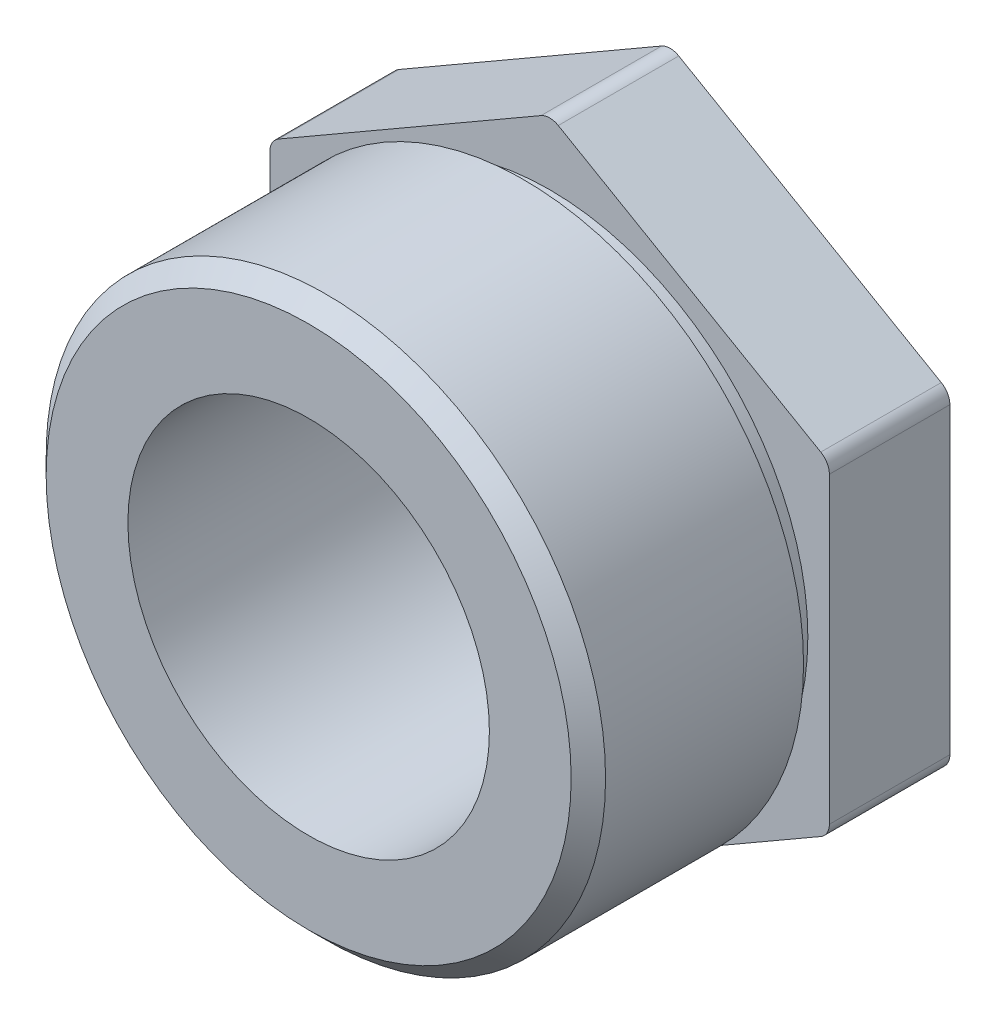
ISO-10303-21;
HEADER;
FILE_DESCRIPTION(('STEP AP214'),'2;1');
FILE_NAME('part.step','',(''),(''),'','','');
FILE_SCHEMA(('AUTOMOTIVE_DESIGN { 1 0 10303 214 1 1 1 1 }'));
ENDSEC;
DATA;
#1=APPLICATION_CONTEXT('core data for automotive mechanical design processes');
#2=APPLICATION_PROTOCOL_DEFINITION('international standard','automotive_design',2000,#1);
#3=PRODUCT_CONTEXT('',#1,'mechanical');
#4=PRODUCT('Part','Part','',(#3));
#5=PRODUCT_RELATED_PRODUCT_CATEGORY('part','',(#4));
#6=PRODUCT_DEFINITION_FORMATION('','',#4);
#7=PRODUCT_DEFINITION_CONTEXT('part definition',#1,'design');
#8=PRODUCT_DEFINITION('design','',#6,#7);
#9=PRODUCT_DEFINITION_SHAPE('','',#8);
#10=(LENGTH_UNIT() NAMED_UNIT(*) SI_UNIT(.MILLI.,.METRE.));
#11=(NAMED_UNIT(*) PLANE_ANGLE_UNIT() SI_UNIT($,.RADIAN.));
#12=(NAMED_UNIT(*) SI_UNIT($,.STERADIAN.) SOLID_ANGLE_UNIT());
#13=UNCERTAINTY_MEASURE_WITH_UNIT(LENGTH_MEASURE(1.E-05),#10,'distance_accuracy_value','');
#14=(GEOMETRIC_REPRESENTATION_CONTEXT(3) GLOBAL_UNCERTAINTY_ASSIGNED_CONTEXT((#13)) GLOBAL_UNIT_ASSIGNED_CONTEXT((#10,
#11,#12)) REPRESENTATION_CONTEXT('',''));
#15=CARTESIAN_POINT('',(0.,0.,0.));
#16=DIRECTION('',(0.,0.,1.));
#17=DIRECTION('',(1.,0.,0.));
#18=AXIS2_PLACEMENT_3D('',#15,#16,#17);
#19=CARTESIAN_POINT('',(0.,0.,42.));
#20=DIRECTION('',(0.,0.,-1.));
#21=DIRECTION('',(-1.,0.,0.));
#22=AXIS2_PLACEMENT_3D('',#19,#20,#21);
#23=CYLINDRICAL_SURFACE('',#22,32.5);
#24=CARTESIAN_POINT('',(0.,0.,40.0000000000001));
#25=DIRECTION('',(0.,0.,1.));
#26=DIRECTION('',(1.,0.,0.));
#27=AXIS2_PLACEMENT_3D('',#24,#25,#26);
#28=CIRCLE('',#27,32.5);
#29=CARTESIAN_POINT('',(32.5,0.,40.0000000000001));
#30=VERTEX_POINT('',#29);
#31=EDGE_CURVE('E11',#30,#30,#28,.F.);
#32=ORIENTED_EDGE('',*,*,#31,.T.);
#33=EDGE_LOOP('',(#32));
#34=FACE_BOUND('',#33,.T.);
#35=CARTESIAN_POINT('',(0.,0.,17.));
#36=DIRECTION('',(0.,0.,1.));
#37=DIRECTION('',(1.,0.,0.));
#38=AXIS2_PLACEMENT_3D('',#35,#36,#37);
#39=CIRCLE('',#38,32.5);
#40=CARTESIAN_POINT('',(32.5,0.,17.));
#41=VERTEX_POINT('',#40);
#42=EDGE_CURVE('E155',#41,#41,#39,.T.);
#43=ORIENTED_EDGE('',*,*,#42,.T.);
#44=EDGE_LOOP('',(#43));
#45=FACE_BOUND('',#44,.T.);
#46=ADVANCED_FACE('F39',(#34,#45),#23,.T.);
#47=CARTESIAN_POINT('',(0.,0.,42.));
#48=DIRECTION('',(0.,0.,1.));
#49=DIRECTION('',(1.,0.,0.));
#50=AXIS2_PLACEMENT_3D('',#47,#48,#49);
#51=PLANE('',#50);
#52=CARTESIAN_POINT('',(0.,0.,42.));
#53=DIRECTION('',(0.,0.,1.));
#54=DIRECTION('',(1.,0.,0.));
#55=AXIS2_PLACEMENT_3D('',#52,#53,#54);
#56=CIRCLE('',#55,21.);
#57=CARTESIAN_POINT('',(21.,0.,42.));
#58=VERTEX_POINT('',#57);
#59=EDGE_CURVE('E278',#58,#58,#56,.T.);
#60=ORIENTED_EDGE('',*,*,#59,.F.);
#61=EDGE_LOOP('',(#60));
#62=FACE_BOUND('',#61,.T.);
#63=CARTESIAN_POINT('',(0.,0.,42.));
#64=DIRECTION('',(0.,0.,1.));
#65=DIRECTION('',(1.,0.,0.));
#66=AXIS2_PLACEMENT_3D('',#63,#64,#65);
#67=CIRCLE('',#66,30.5);
#68=CARTESIAN_POINT('',(30.5,0.,42.));
#69=VERTEX_POINT('',#68);
#70=EDGE_CURVE('E47',#69,#69,#67,.T.);
#71=ORIENTED_EDGE('',*,*,#70,.T.);
#72=EDGE_LOOP('',(#71));
#73=FACE_BOUND('',#72,.T.);
#74=ADVANCED_FACE('F207',(#62,#73),#51,.T.);
#75=CARTESIAN_POINT('',(0.,0.,17.));
#76=DIRECTION('',(0.,0.,1.));
#77=DIRECTION('',(1.,0.,0.));
#78=AXIS2_PLACEMENT_3D('',#75,#76,#77);
#79=PLANE('',#78);
#80=ORIENTED_EDGE('',*,*,#42,.F.);
#81=EDGE_LOOP('',(#80));
#82=FACE_BOUND('',#81,.T.);
#83=CARTESIAN_POINT('',(0.,0.,17.));
#84=DIRECTION('',(0.,0.,1.));
#85=DIRECTION('',(1.,0.,0.));
#86=AXIS2_PLACEMENT_3D('',#83,#84,#85);
#87=CIRCLE('',#86,30.);
#88=CARTESIAN_POINT('',(30.,0.,17.));
#89=VERTEX_POINT('',#88);
#90=EDGE_CURVE('E159',#89,#89,#87,.T.);
#91=ORIENTED_EDGE('',*,*,#90,.T.);
#92=EDGE_LOOP('',(#91));
#93=FACE_BOUND('',#92,.T.);
#94=ADVANCED_FACE('F226',(#82,#93),#79,.F.);
#95=CARTESIAN_POINT('',(0.,0.,14.));
#96=DIRECTION('',(0.,0.,1.));
#97=DIRECTION('',(1.,0.,0.));
#98=AXIS2_PLACEMENT_3D('',#95,#96,#97);
#99=PLANE('',#98);
#100=DIRECTION('',(-0.866025403784439,-0.5,0.));
#101=VECTOR('',#100,1.);
#102=CARTESIAN_POINT('',(32.5,-18.7638837486628,14.));
#103=LINE('',#102,#101);
#104=CARTESIAN_POINT('',(31.5,-19.3412340178525,14.));
#105=VERTEX_POINT('',#104);
#106=CARTESIAN_POINT('',(1.,-36.950417228136,14.));
#107=VERTEX_POINT('',#106);
#108=EDGE_CURVE('E282',#105,#107,#103,.T.);
#109=ORIENTED_EDGE('',*,*,#108,.F.);
#110=CARTESIAN_POINT('',(30.5,-17.6091832102836,14.));
#111=DIRECTION('',(0.,0.,1.));
#112=DIRECTION('',(1.,0.,0.));
#113=AXIS2_PLACEMENT_3D('',#110,#111,#112);
#114=CIRCLE('',#113,2.);
#115=CARTESIAN_POINT('',(32.5,-17.6091832102836,14.));
#116=VERTEX_POINT('',#115);
#117=EDGE_CURVE('E185',#105,#116,#114,.T.);
#118=ORIENTED_EDGE('',*,*,#117,.T.);
#119=DIRECTION('',(0.,-1.,0.));
#120=VECTOR('',#119,1.);
#121=CARTESIAN_POINT('',(32.5,18.7638837486628,14.));
#122=LINE('',#121,#120);
#123=CARTESIAN_POINT('',(32.5,17.6091832102836,14.));
#124=VERTEX_POINT('',#123);
#125=EDGE_CURVE('E272',#124,#116,#122,.T.);
#126=ORIENTED_EDGE('',*,*,#125,.F.);
#127=CARTESIAN_POINT('',(30.5,17.6091832102836,14.));
#128=DIRECTION('',(0.,0.,1.));
#129=DIRECTION('',(1.,0.,0.));
#130=AXIS2_PLACEMENT_3D('',#127,#128,#129);
#131=CIRCLE('',#130,2.);
#132=CARTESIAN_POINT('',(31.5,19.3412340178525,14.));
#133=VERTEX_POINT('',#132);
#134=EDGE_CURVE('E154',#124,#133,#131,.T.);
#135=ORIENTED_EDGE('',*,*,#134,.T.);
#136=DIRECTION('',(0.866025403784439,-0.5,0.));
#137=VECTOR('',#136,1.);
#138=CARTESIAN_POINT('',(0.,37.5277674973257,14.));
#139=LINE('',#138,#137);
#140=CARTESIAN_POINT('',(1.00000000000001,36.9504172281361,14.));
#141=VERTEX_POINT('',#140);
#142=EDGE_CURVE('E264',#141,#133,#139,.T.);
#143=ORIENTED_EDGE('',*,*,#142,.F.);
#144=CARTESIAN_POINT('',(0.,35.2183664205672,14.));
#145=DIRECTION('',(0.,0.,1.));
#146=DIRECTION('',(1.,0.,0.));
#147=AXIS2_PLACEMENT_3D('',#144,#145,#146);
#148=CIRCLE('',#147,2.);
#149=CARTESIAN_POINT('',(-0.999999999999994,36.9504172281361,14.));
#150=VERTEX_POINT('',#149);
#151=EDGE_CURVE('E178',#141,#150,#148,.T.);
#152=ORIENTED_EDGE('',*,*,#151,.T.);
#153=DIRECTION('',(0.866025403784439,0.5,0.));
#154=VECTOR('',#153,1.);
#155=CARTESIAN_POINT('',(-32.5,18.7638837486628,14.));
#156=LINE('',#155,#154);
#157=CARTESIAN_POINT('',(-31.5,19.3412340178525,14.));
#158=VERTEX_POINT('',#157);
#159=EDGE_CURVE('E261',#158,#150,#156,.T.);
#160=ORIENTED_EDGE('',*,*,#159,.F.);
#161=CARTESIAN_POINT('',(-30.5,17.6091832102836,14.));
#162=DIRECTION('',(0.,0.,1.));
#163=DIRECTION('',(1.,0.,0.));
#164=AXIS2_PLACEMENT_3D('',#161,#162,#163);
#165=CIRCLE('',#164,2.);
#166=CARTESIAN_POINT('',(-32.5,17.6091832102836,14.));
#167=VERTEX_POINT('',#166);
#168=EDGE_CURVE('E180',#158,#167,#165,.T.);
#169=ORIENTED_EDGE('',*,*,#168,.T.);
#170=DIRECTION('',(0.,1.,0.));
#171=VECTOR('',#170,1.);
#172=CARTESIAN_POINT('',(-32.5,-18.7638837486628,14.));
#173=LINE('',#172,#171);
#174=CARTESIAN_POINT('',(-32.5,-17.6091832102836,14.));
#175=VERTEX_POINT('',#174);
#176=EDGE_CURVE('E287',#175,#167,#173,.T.);
#177=ORIENTED_EDGE('',*,*,#176,.F.);
#178=CARTESIAN_POINT('',(-30.5,-17.6091832102836,14.));
#179=DIRECTION('',(0.,0.,1.));
#180=DIRECTION('',(1.,0.,0.));
#181=AXIS2_PLACEMENT_3D('',#178,#179,#180);
#182=CIRCLE('',#181,2.);
#183=CARTESIAN_POINT('',(-31.5,-19.3412340178525,14.));
#184=VERTEX_POINT('',#183);
#185=EDGE_CURVE('E54',#175,#184,#182,.T.);
#186=ORIENTED_EDGE('',*,*,#185,.T.);
#187=DIRECTION('',(-0.866025403784439,0.5,0.));
#188=VECTOR('',#187,1.);
#189=CARTESIAN_POINT('',(0.,-37.5277674973257,14.));
#190=LINE('',#189,#188);
#191=CARTESIAN_POINT('',(-1.,-36.950417228136,14.));
#192=VERTEX_POINT('',#191);
#193=EDGE_CURVE('E285',#192,#184,#190,.T.);
#194=ORIENTED_EDGE('',*,*,#193,.F.);
#195=CARTESIAN_POINT('',(0.,-35.2183664205672,14.));
#196=DIRECTION('',(0.,0.,1.));
#197=DIRECTION('',(1.,0.,0.));
#198=AXIS2_PLACEMENT_3D('',#195,#196,#197);
#199=CIRCLE('',#198,2.);
#200=EDGE_CURVE('E183',#192,#107,#199,.T.);
#201=ORIENTED_EDGE('',*,*,#200,.T.);
#202=EDGE_LOOP('',(#109,#118,#126,#135,#143,#152,#160,#169,#177,#186,#194,#201));
#203=FACE_BOUND('',#202,.T.);
#204=CARTESIAN_POINT('',(0.,0.,14.));
#205=DIRECTION('',(0.,0.,1.));
#206=DIRECTION('',(1.,0.,0.));
#207=AXIS2_PLACEMENT_3D('',#204,#205,#206);
#208=CIRCLE('',#207,30.);
#209=CARTESIAN_POINT('',(30.,0.,14.));
#210=VERTEX_POINT('',#209);
#211=EDGE_CURVE('E290',#210,#210,#208,.T.);
#212=ORIENTED_EDGE('',*,*,#211,.F.);
#213=EDGE_LOOP('',(#212));
#214=FACE_BOUND('',#213,.T.);
#215=ADVANCED_FACE('F259',(#203,#214),#99,.T.);
#216=CARTESIAN_POINT('',(0.,0.,17.));
#217=DIRECTION('',(0.,0.,-1.));
#218=DIRECTION('',(-1.,0.,0.));
#219=AXIS2_PLACEMENT_3D('',#216,#217,#218);
#220=CYLINDRICAL_SURFACE('',#219,30.);
#221=ORIENTED_EDGE('',*,*,#90,.F.);
#222=EDGE_LOOP('',(#221));
#223=FACE_BOUND('',#222,.T.);
#224=ORIENTED_EDGE('',*,*,#211,.T.);
#225=EDGE_LOOP('',(#224));
#226=FACE_BOUND('',#225,.T.);
#227=ADVANCED_FACE('F303',(#223,#226),#220,.T.);
#228=CARTESIAN_POINT('',(-32.5,18.7638837486628,14.));
#229=DIRECTION('',(-0.5,0.866025403784439,0.));
#230=DIRECTION('',(-0.866025403784439,-0.5,0.));
#231=AXIS2_PLACEMENT_3D('',#228,#229,#230);
#232=PLANE('',#231);
#233=DIRECTION('',(0.866025403784439,0.5,0.));
#234=VECTOR('',#233,1.);
#235=CARTESIAN_POINT('',(-32.5,18.7638837486628,0.));
#236=LINE('',#235,#234);
#237=CARTESIAN_POINT('',(-31.5,19.3412340178525,0.));
#238=VERTEX_POINT('',#237);
#239=CARTESIAN_POINT('',(-0.999999999999994,36.9504172281361,0.));
#240=VERTEX_POINT('',#239);
#241=EDGE_CURVE('E291',#238,#240,#236,.T.);
#242=ORIENTED_EDGE('',*,*,#241,.F.);
#243=DIRECTION('',(0.,0.,-1.));
#244=VECTOR('',#243,1.);
#245=CARTESIAN_POINT('',(-31.5,19.3412340178525,14.));
#246=LINE('',#245,#244);
#247=EDGE_CURVE('E199',#238,#158,#246,.F.);
#248=ORIENTED_EDGE('',*,*,#247,.T.);
#249=ORIENTED_EDGE('',*,*,#159,.T.);
#250=DIRECTION('',(0.,0.,-1.));
#251=VECTOR('',#250,1.);
#252=CARTESIAN_POINT('',(-0.999999999999987,36.9504172281361,14.));
#253=LINE('',#252,#251);
#254=EDGE_CURVE('E196',#150,#240,#253,.T.);
#255=ORIENTED_EDGE('',*,*,#254,.T.);
#256=EDGE_LOOP('',(#242,#248,#249,#255));
#257=FACE_BOUND('',#256,.T.);
#258=ADVANCED_FACE('F267',(#257),#232,.T.);
#259=CARTESIAN_POINT('',(-32.5,-18.7638837486628,14.));
#260=DIRECTION('',(-1.,0.,0.));
#261=DIRECTION('',(0.,-1.,0.));
#262=AXIS2_PLACEMENT_3D('',#259,#260,#261);
#263=PLANE('',#262);
#264=DIRECTION('',(0.,1.,0.));
#265=VECTOR('',#264,1.);
#266=CARTESIAN_POINT('',(-32.5,-18.7638837486628,0.));
#267=LINE('',#266,#265);
#268=CARTESIAN_POINT('',(-32.5,-17.6091832102836,0.));
#269=VERTEX_POINT('',#268);
#270=CARTESIAN_POINT('',(-32.5,17.6091832102836,0.));
#271=VERTEX_POINT('',#270);
#272=EDGE_CURVE('E270',#269,#271,#267,.T.);
#273=ORIENTED_EDGE('',*,*,#272,.F.);
#274=DIRECTION('',(0.,0.,-1.));
#275=VECTOR('',#274,1.);
#276=CARTESIAN_POINT('',(-32.5,-17.6091832102836,14.));
#277=LINE('',#276,#275);
#278=EDGE_CURVE('E194',#269,#175,#277,.F.);
#279=ORIENTED_EDGE('',*,*,#278,.T.);
#280=ORIENTED_EDGE('',*,*,#176,.T.);
#281=DIRECTION('',(0.,0.,-1.));
#282=VECTOR('',#281,1.);
#283=CARTESIAN_POINT('',(-32.5,17.6091832102836,14.));
#284=LINE('',#283,#282);
#285=EDGE_CURVE('E191',#167,#271,#284,.T.);
#286=ORIENTED_EDGE('',*,*,#285,.T.);
#287=EDGE_LOOP('',(#273,#279,#280,#286));
#288=FACE_BOUND('',#287,.T.);
#289=ADVANCED_FACE('F317',(#288),#263,.T.);
#290=CARTESIAN_POINT('',(0.,-37.5277674973257,14.));
#291=DIRECTION('',(-0.5,-0.866025403784439,0.));
#292=DIRECTION('',(0.866025403784439,-0.5,0.));
#293=AXIS2_PLACEMENT_3D('',#290,#291,#292);
#294=PLANE('',#293);
#295=DIRECTION('',(-0.866025403784439,0.5,0.));
#296=VECTOR('',#295,1.);
#297=CARTESIAN_POINT('',(0.,-37.5277674973257,0.));
#298=LINE('',#297,#296);
#299=CARTESIAN_POINT('',(-1.,-36.950417228136,0.));
#300=VERTEX_POINT('',#299);
#301=CARTESIAN_POINT('',(-31.5,-19.3412340178525,0.));
#302=VERTEX_POINT('',#301);
#303=EDGE_CURVE('E275',#300,#302,#298,.T.);
#304=ORIENTED_EDGE('',*,*,#303,.F.);
#305=DIRECTION('',(0.,0.,-1.));
#306=VECTOR('',#305,1.);
#307=CARTESIAN_POINT('',(-1.,-36.950417228136,14.));
#308=LINE('',#307,#306);
#309=EDGE_CURVE('E61',#300,#192,#308,.F.);
#310=ORIENTED_EDGE('',*,*,#309,.T.);
#311=ORIENTED_EDGE('',*,*,#193,.T.);
#312=DIRECTION('',(0.,0.,-1.));
#313=VECTOR('',#312,1.);
#314=CARTESIAN_POINT('',(-31.5,-19.3412340178525,14.));
#315=LINE('',#314,#313);
#316=EDGE_CURVE('E187',#184,#302,#315,.T.);
#317=ORIENTED_EDGE('',*,*,#316,.T.);
#318=EDGE_LOOP('',(#304,#310,#311,#317));
#319=FACE_BOUND('',#318,.T.);
#320=ADVANCED_FACE('F327',(#319),#294,.T.);
#321=CARTESIAN_POINT('',(32.5,-18.7638837486628,14.));
#322=DIRECTION('',(0.5,-0.866025403784439,0.));
#323=DIRECTION('',(0.866025403784439,0.5,0.));
#324=AXIS2_PLACEMENT_3D('',#321,#322,#323);
#325=PLANE('',#324);
#326=DIRECTION('',(-0.866025403784439,-0.5,0.));
#327=VECTOR('',#326,1.);
#328=CARTESIAN_POINT('',(32.5,-18.7638837486628,0.));
#329=LINE('',#328,#327);
#330=CARTESIAN_POINT('',(31.5,-19.3412340178525,0.));
#331=VERTEX_POINT('',#330);
#332=CARTESIAN_POINT('',(1.,-36.950417228136,0.));
#333=VERTEX_POINT('',#332);
#334=EDGE_CURVE('E150',#331,#333,#329,.T.);
#335=ORIENTED_EDGE('',*,*,#334,.F.);
#336=DIRECTION('',(0.,0.,-1.));
#337=VECTOR('',#336,1.);
#338=CARTESIAN_POINT('',(31.5,-19.3412340178525,14.));
#339=LINE('',#338,#337);
#340=EDGE_CURVE('E175',#331,#105,#339,.F.);
#341=ORIENTED_EDGE('',*,*,#340,.T.);
#342=ORIENTED_EDGE('',*,*,#108,.T.);
#343=DIRECTION('',(0.,0.,-1.));
#344=VECTOR('',#343,1.);
#345=CARTESIAN_POINT('',(1.,-36.950417228136,14.));
#346=LINE('',#345,#344);
#347=EDGE_CURVE('E172',#107,#333,#346,.T.);
#348=ORIENTED_EDGE('',*,*,#347,.T.);
#349=EDGE_LOOP('',(#335,#341,#342,#348));
#350=FACE_BOUND('',#349,.T.);
#351=ADVANCED_FACE('F324',(#350),#325,.T.);
#352=CARTESIAN_POINT('',(32.5,18.7638837486628,14.));
#353=DIRECTION('',(1.,0.,0.));
#354=DIRECTION('',(0.,0.,-1.));
#355=AXIS2_PLACEMENT_3D('',#352,#353,#354);
#356=PLANE('',#355);
#357=ORIENTED_EDGE('',*,*,#125,.T.);
#358=DIRECTION('',(0.,0.,-1.));
#359=VECTOR('',#358,1.);
#360=CARTESIAN_POINT('',(32.5,-17.6091832102836,14.));
#361=LINE('',#360,#359);
#362=CARTESIAN_POINT('',(32.5,-17.6091832102836,0.));
#363=VERTEX_POINT('',#362);
#364=EDGE_CURVE('E141',#116,#363,#361,.T.);
#365=ORIENTED_EDGE('',*,*,#364,.T.);
#366=DIRECTION('',(0.,-1.,0.));
#367=VECTOR('',#366,1.);
#368=CARTESIAN_POINT('',(32.5,18.7638837486628,0.));
#369=LINE('',#368,#367);
#370=CARTESIAN_POINT('',(32.5,17.6091832102836,0.));
#371=VERTEX_POINT('',#370);
#372=EDGE_CURVE('E133',#371,#363,#369,.T.);
#373=ORIENTED_EDGE('',*,*,#372,.F.);
#374=DIRECTION('',(0.,0.,-1.));
#375=VECTOR('',#374,1.);
#376=CARTESIAN_POINT('',(32.5,17.6091832102836,14.));
#377=LINE('',#376,#375);
#378=EDGE_CURVE('E147',#371,#124,#377,.F.);
#379=ORIENTED_EDGE('',*,*,#378,.T.);
#380=EDGE_LOOP('',(#357,#365,#373,#379));
#381=FACE_BOUND('',#380,.T.);
#382=ADVANCED_FACE('F146',(#381),#356,.T.);
#383=CARTESIAN_POINT('',(0.,37.5277674973257,14.));
#384=DIRECTION('',(0.5,0.866025403784439,0.));
#385=DIRECTION('',(-0.866025403784439,0.5,0.));
#386=AXIS2_PLACEMENT_3D('',#383,#384,#385);
#387=PLANE('',#386);
#388=DIRECTION('',(0.866025403784439,-0.5,0.));
#389=VECTOR('',#388,1.);
#390=CARTESIAN_POINT('',(0.,37.5277674973257,0.));
#391=LINE('',#390,#389);
#392=CARTESIAN_POINT('',(1.00000000000001,36.9504172281361,0.));
#393=VERTEX_POINT('',#392);
#394=CARTESIAN_POINT('',(31.5,19.3412340178525,0.));
#395=VERTEX_POINT('',#394);
#396=EDGE_CURVE('E135',#393,#395,#391,.T.);
#397=ORIENTED_EDGE('',*,*,#396,.F.);
#398=DIRECTION('',(0.,0.,-1.));
#399=VECTOR('',#398,1.);
#400=CARTESIAN_POINT('',(1.00000000000001,36.9504172281361,14.));
#401=LINE('',#400,#399);
#402=EDGE_CURVE('E203',#393,#141,#401,.F.);
#403=ORIENTED_EDGE('',*,*,#402,.T.);
#404=ORIENTED_EDGE('',*,*,#142,.T.);
#405=DIRECTION('',(0.,0.,-1.));
#406=VECTOR('',#405,1.);
#407=CARTESIAN_POINT('',(31.5,19.3412340178525,14.));
#408=LINE('',#407,#406);
#409=EDGE_CURVE('E201',#133,#395,#408,.T.);
#410=ORIENTED_EDGE('',*,*,#409,.T.);
#411=EDGE_LOOP('',(#397,#403,#404,#410));
#412=FACE_BOUND('',#411,.T.);
#413=ADVANCED_FACE('F318',(#412),#387,.T.);
#414=CARTESIAN_POINT('',(0.,0.,0.));
#415=DIRECTION('',(0.,0.,1.));
#416=DIRECTION('',(1.,0.,0.));
#417=AXIS2_PLACEMENT_3D('',#414,#415,#416);
#418=PLANE('',#417);
#419=CARTESIAN_POINT('',(0.,0.,0.));
#420=DIRECTION('',(0.,0.,1.));
#421=DIRECTION('',(1.,0.,0.));
#422=AXIS2_PLACEMENT_3D('',#419,#420,#421);
#423=CIRCLE('',#422,21.);
#424=CARTESIAN_POINT('',(21.,0.,0.));
#425=VERTEX_POINT('',#424);
#426=EDGE_CURVE('E293',#425,#425,#423,.T.);
#427=ORIENTED_EDGE('',*,*,#426,.T.);
#428=EDGE_LOOP('',(#427));
#429=FACE_BOUND('',#428,.T.);
#430=ORIENTED_EDGE('',*,*,#372,.T.);
#431=CARTESIAN_POINT('',(30.5,-17.6091832102836,0.));
#432=DIRECTION('',(0.,0.,1.));
#433=DIRECTION('',(1.,0.,0.));
#434=AXIS2_PLACEMENT_3D('',#431,#432,#433);
#435=CIRCLE('',#434,2.);
#436=EDGE_CURVE('E170',#363,#331,#435,.F.);
#437=ORIENTED_EDGE('',*,*,#436,.T.);
#438=ORIENTED_EDGE('',*,*,#334,.T.);
#439=CARTESIAN_POINT('',(0.,-35.2183664205672,0.));
#440=DIRECTION('',(0.,0.,1.));
#441=DIRECTION('',(1.,0.,0.));
#442=AXIS2_PLACEMENT_3D('',#439,#440,#441);
#443=CIRCLE('',#442,2.);
#444=EDGE_CURVE('E168',#333,#300,#443,.F.);
#445=ORIENTED_EDGE('',*,*,#444,.T.);
#446=ORIENTED_EDGE('',*,*,#303,.T.);
#447=CARTESIAN_POINT('',(-30.5,-17.6091832102836,0.));
#448=DIRECTION('',(0.,0.,1.));
#449=DIRECTION('',(1.,0.,0.));
#450=AXIS2_PLACEMENT_3D('',#447,#448,#449);
#451=CIRCLE('',#450,2.);
#452=EDGE_CURVE('E166',#302,#269,#451,.F.);
#453=ORIENTED_EDGE('',*,*,#452,.T.);
#454=ORIENTED_EDGE('',*,*,#272,.T.);
#455=CARTESIAN_POINT('',(-30.5,17.6091832102836,0.));
#456=DIRECTION('',(0.,0.,1.));
#457=DIRECTION('',(1.,0.,0.));
#458=AXIS2_PLACEMENT_3D('',#455,#456,#457);
#459=CIRCLE('',#458,2.);
#460=EDGE_CURVE('E164',#271,#238,#459,.F.);
#461=ORIENTED_EDGE('',*,*,#460,.T.);
#462=ORIENTED_EDGE('',*,*,#241,.T.);
#463=CARTESIAN_POINT('',(0.,35.2183664205672,0.));
#464=DIRECTION('',(0.,0.,1.));
#465=DIRECTION('',(1.,0.,0.));
#466=AXIS2_PLACEMENT_3D('',#463,#464,#465);
#467=CIRCLE('',#466,2.);
#468=EDGE_CURVE('E140',#240,#393,#467,.F.);
#469=ORIENTED_EDGE('',*,*,#468,.T.);
#470=ORIENTED_EDGE('',*,*,#396,.T.);
#471=CARTESIAN_POINT('',(30.5,17.6091832102836,0.));
#472=DIRECTION('',(0.,0.,1.));
#473=DIRECTION('',(1.,0.,0.));
#474=AXIS2_PLACEMENT_3D('',#471,#472,#473);
#475=CIRCLE('',#474,2.);
#476=EDGE_CURVE('E130',#395,#371,#475,.F.);
#477=ORIENTED_EDGE('',*,*,#476,.T.);
#478=EDGE_LOOP('',(#430,#437,#438,#445,#446,#453,#454,#461,#462,#469,#470,#477));
#479=FACE_BOUND('',#478,.T.);
#480=ADVANCED_FACE('F132',(#429,#479),#418,.F.);
#481=CARTESIAN_POINT('',(30.5,-17.6091832102836,14.));
#482=DIRECTION('',(0.,0.,-1.));
#483=DIRECTION('',(-1.,0.,0.));
#484=AXIS2_PLACEMENT_3D('',#481,#482,#483);
#485=CYLINDRICAL_SURFACE('',#484,2.);
#486=ORIENTED_EDGE('',*,*,#117,.F.);
#487=ORIENTED_EDGE('',*,*,#340,.F.);
#488=ORIENTED_EDGE('',*,*,#436,.F.);
#489=ORIENTED_EDGE('',*,*,#364,.F.);
#490=EDGE_LOOP('',(#486,#487,#488,#489));
#491=FACE_BOUND('',#490,.T.);
#492=ADVANCED_FACE('F232',(#491),#485,.T.);
#493=CARTESIAN_POINT('',(0.,-35.2183664205672,14.));
#494=DIRECTION('',(0.,0.,-1.));
#495=DIRECTION('',(-1.,0.,0.));
#496=AXIS2_PLACEMENT_3D('',#493,#494,#495);
#497=CYLINDRICAL_SURFACE('',#496,2.);
#498=ORIENTED_EDGE('',*,*,#200,.F.);
#499=ORIENTED_EDGE('',*,*,#309,.F.);
#500=ORIENTED_EDGE('',*,*,#444,.F.);
#501=ORIENTED_EDGE('',*,*,#347,.F.);
#502=EDGE_LOOP('',(#498,#499,#500,#501));
#503=FACE_BOUND('',#502,.T.);
#504=ADVANCED_FACE('F235',(#503),#497,.T.);
#505=CARTESIAN_POINT('',(-30.5,-17.6091832102836,14.));
#506=DIRECTION('',(0.,0.,-1.));
#507=DIRECTION('',(-1.,0.,0.));
#508=AXIS2_PLACEMENT_3D('',#505,#506,#507);
#509=CYLINDRICAL_SURFACE('',#508,2.);
#510=ORIENTED_EDGE('',*,*,#185,.F.);
#511=ORIENTED_EDGE('',*,*,#278,.F.);
#512=ORIENTED_EDGE('',*,*,#452,.F.);
#513=ORIENTED_EDGE('',*,*,#316,.F.);
#514=EDGE_LOOP('',(#510,#511,#512,#513));
#515=FACE_BOUND('',#514,.T.);
#516=ADVANCED_FACE('F239',(#515),#509,.T.);
#517=CARTESIAN_POINT('',(-30.5,17.6091832102836,14.));
#518=DIRECTION('',(0.,0.,-1.));
#519=DIRECTION('',(-1.,0.,0.));
#520=AXIS2_PLACEMENT_3D('',#517,#518,#519);
#521=CYLINDRICAL_SURFACE('',#520,2.);
#522=ORIENTED_EDGE('',*,*,#168,.F.);
#523=ORIENTED_EDGE('',*,*,#247,.F.);
#524=ORIENTED_EDGE('',*,*,#460,.F.);
#525=ORIENTED_EDGE('',*,*,#285,.F.);
#526=EDGE_LOOP('',(#522,#523,#524,#525));
#527=FACE_BOUND('',#526,.T.);
#528=ADVANCED_FACE('F243',(#527),#521,.T.);
#529=CARTESIAN_POINT('',(0.,35.2183664205672,14.));
#530=DIRECTION('',(0.,0.,-1.));
#531=DIRECTION('',(-1.,0.,0.));
#532=AXIS2_PLACEMENT_3D('',#529,#530,#531);
#533=CYLINDRICAL_SURFACE('',#532,2.);
#534=ORIENTED_EDGE('',*,*,#151,.F.);
#535=ORIENTED_EDGE('',*,*,#402,.F.);
#536=ORIENTED_EDGE('',*,*,#468,.F.);
#537=ORIENTED_EDGE('',*,*,#254,.F.);
#538=EDGE_LOOP('',(#534,#535,#536,#537));
#539=FACE_BOUND('',#538,.T.);
#540=ADVANCED_FACE('F218',(#539),#533,.T.);
#541=CARTESIAN_POINT('',(30.5,17.6091832102836,14.));
#542=DIRECTION('',(0.,0.,-1.));
#543=DIRECTION('',(-1.,0.,0.));
#544=AXIS2_PLACEMENT_3D('',#541,#542,#543);
#545=CYLINDRICAL_SURFACE('',#544,2.);
#546=ORIENTED_EDGE('',*,*,#134,.F.);
#547=ORIENTED_EDGE('',*,*,#378,.F.);
#548=ORIENTED_EDGE('',*,*,#476,.F.);
#549=ORIENTED_EDGE('',*,*,#409,.F.);
#550=EDGE_LOOP('',(#546,#547,#548,#549));
#551=FACE_BOUND('',#550,.T.);
#552=ADVANCED_FACE('F153',(#551),#545,.T.);
#553=CARTESIAN_POINT('',(0.,0.,42.));
#554=DIRECTION('',(0.,0.,-1.));
#555=DIRECTION('',(-1.,0.,0.));
#556=AXIS2_PLACEMENT_3D('',#553,#554,#555);
#557=CONICAL_SURFACE('',#556,30.5,0.78539816339745);
#558=ORIENTED_EDGE('',*,*,#31,.F.);
#559=EDGE_LOOP('',(#558));
#560=FACE_BOUND('',#559,.T.);
#561=ORIENTED_EDGE('',*,*,#70,.F.);
#562=EDGE_LOOP('',(#561));
#563=FACE_BOUND('',#562,.T.);
#564=ADVANCED_FACE('F41',(#560,#563),#557,.T.);
#565=CARTESIAN_POINT('',(0.,0.,0.));
#566=DIRECTION('',(0.,0.,1.));
#567=DIRECTION('',(1.,0.,0.));
#568=AXIS2_PLACEMENT_3D('',#565,#566,#567);
#569=CYLINDRICAL_SURFACE('',#568,21.);
#570=ORIENTED_EDGE('',*,*,#426,.F.);
#571=EDGE_LOOP('',(#570));
#572=FACE_BOUND('',#571,.T.);
#573=ORIENTED_EDGE('',*,*,#59,.T.);
#574=EDGE_LOOP('',(#573));
#575=FACE_BOUND('',#574,.T.);
#576=ADVANCED_FACE('F210',(#572,#575),#569,.F.);
#577=CLOSED_SHELL('',(#46,#74,#94,#215,#227,#258,#289,#320,#351,#382,#413,#480,#492,#504,#516,
#528,#540,#552,#564,#576));
#578=MANIFOLD_SOLID_BREP('B2',#577);
#579=ADVANCED_BREP_SHAPE_REPRESENTATION('',(#18,#578),#14);
#580=SHAPE_DEFINITION_REPRESENTATION(#9,#579);
ENDSEC;
END-ISO-10303-21;
